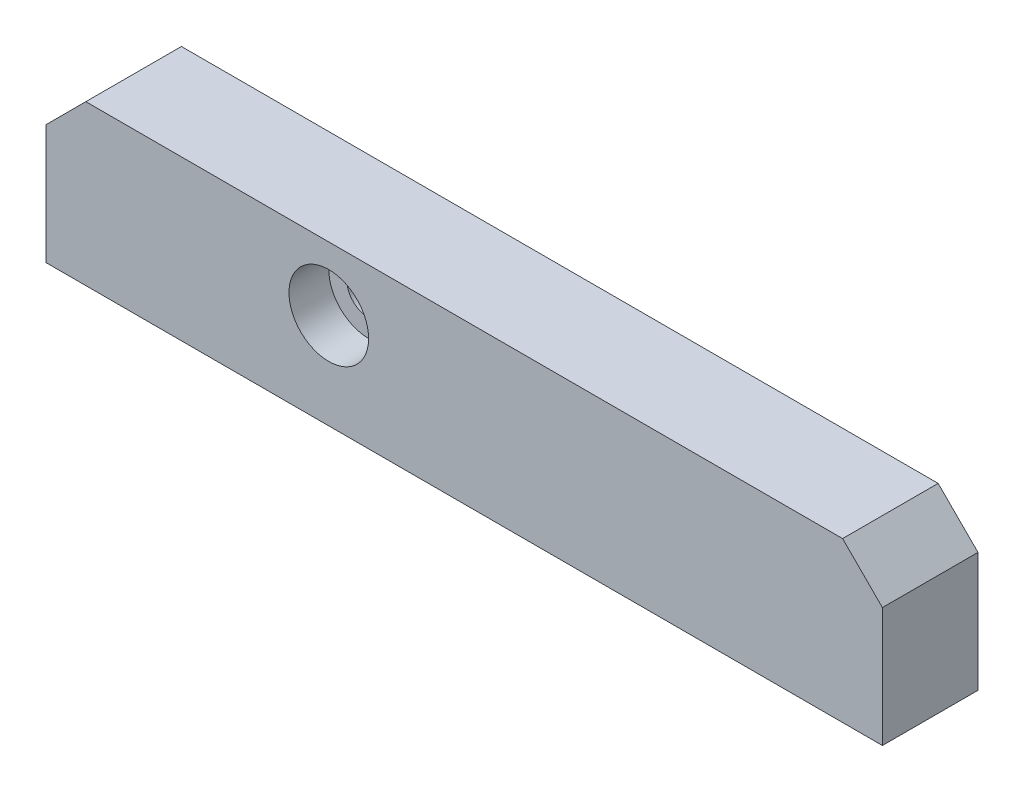
ISO-10303-21;
HEADER;
FILE_DESCRIPTION(('STEP AP214'),'2;1');
FILE_NAME('part.step','',(''),(''),'','','');
FILE_SCHEMA(('AUTOMOTIVE_DESIGN { 1 0 10303 214 1 1 1 1 }'));
ENDSEC;
DATA;
#1=APPLICATION_CONTEXT('core data for automotive mechanical design processes');
#2=APPLICATION_PROTOCOL_DEFINITION('international standard','automotive_design',2000,#1);
#3=PRODUCT_CONTEXT('',#1,'mechanical');
#4=PRODUCT('Part','Part','',(#3));
#5=PRODUCT_RELATED_PRODUCT_CATEGORY('part','',(#4));
#6=PRODUCT_DEFINITION_FORMATION('','',#4);
#7=PRODUCT_DEFINITION_CONTEXT('part definition',#1,'design');
#8=PRODUCT_DEFINITION('design','',#6,#7);
#9=PRODUCT_DEFINITION_SHAPE('','',#8);
#10=(LENGTH_UNIT() NAMED_UNIT(*) SI_UNIT(.MILLI.,.METRE.));
#11=(NAMED_UNIT(*) PLANE_ANGLE_UNIT() SI_UNIT($,.RADIAN.));
#12=(NAMED_UNIT(*) SI_UNIT($,.STERADIAN.) SOLID_ANGLE_UNIT());
#13=UNCERTAINTY_MEASURE_WITH_UNIT(LENGTH_MEASURE(1.E-05),#10,'distance_accuracy_value','');
#14=(GEOMETRIC_REPRESENTATION_CONTEXT(3) GLOBAL_UNCERTAINTY_ASSIGNED_CONTEXT((#13)) GLOBAL_UNIT_ASSIGNED_CONTEXT((#10,
#11,#12)) REPRESENTATION_CONTEXT('',''));
#15=CARTESIAN_POINT('',(0.,0.,0.));
#16=DIRECTION('',(0.,0.,1.));
#17=DIRECTION('',(1.,0.,0.));
#18=AXIS2_PLACEMENT_3D('',#15,#16,#17);
#19=CARTESIAN_POINT('',(-52.5,0.,12.));
#20=DIRECTION('',(1.,0.,0.));
#21=DIRECTION('',(0.,1.,0.));
#22=AXIS2_PLACEMENT_3D('',#19,#20,#21);
#23=PLANE('',#22);
#24=DIRECTION('',(0.,-1.,0.));
#25=VECTOR('',#24,1.);
#26=CARTESIAN_POINT('',(-52.5,0.,0.));
#27=LINE('',#26,#25);
#28=CARTESIAN_POINT('',(-52.5,15.,0.));
#29=VERTEX_POINT('',#28);
#30=CARTESIAN_POINT('',(-52.5,0.,0.));
#31=VERTEX_POINT('',#30);
#32=EDGE_CURVE('E132',#29,#31,#27,.T.);
#33=ORIENTED_EDGE('',*,*,#32,.T.);
#34=DIRECTION('',(0.,0.,-1.));
#35=VECTOR('',#34,1.);
#36=CARTESIAN_POINT('',(-52.5,0.,12.));
#37=LINE('',#36,#35);
#38=CARTESIAN_POINT('',(-52.5,0.,12.));
#39=VERTEX_POINT('',#38);
#40=EDGE_CURVE('E11',#39,#31,#37,.T.);
#41=ORIENTED_EDGE('',*,*,#40,.F.);
#42=DIRECTION('',(0.,-1.,0.));
#43=VECTOR('',#42,1.);
#44=CARTESIAN_POINT('',(-52.5,0.,12.));
#45=LINE('',#44,#43);
#46=CARTESIAN_POINT('',(-52.5,15.,12.));
#47=VERTEX_POINT('',#46);
#48=EDGE_CURVE('E143',#47,#39,#45,.T.);
#49=ORIENTED_EDGE('',*,*,#48,.F.);
#50=DIRECTION('',(0.,0.,-1.));
#51=VECTOR('',#50,1.);
#52=CARTESIAN_POINT('',(-52.5,15.,12.));
#53=LINE('',#52,#51);
#54=EDGE_CURVE('E128',#47,#29,#53,.T.);
#55=ORIENTED_EDGE('',*,*,#54,.T.);
#56=EDGE_LOOP('',(#33,#41,#49,#55));
#57=FACE_BOUND('',#56,.T.);
#58=ADVANCED_FACE('F45',(#57),#23,.F.);
#59=CARTESIAN_POINT('',(-52.5,0.,12.));
#60=DIRECTION('',(0.,1.,0.));
#61=DIRECTION('',(-1.,0.,0.));
#62=AXIS2_PLACEMENT_3D('',#59,#60,#61);
#63=PLANE('',#62);
#64=CARTESIAN_POINT('',(-37.5,0.,6.));
#65=DIRECTION('',(0.,-1.,0.));
#66=DIRECTION('',(0.,0.,-1.));
#67=AXIS2_PLACEMENT_3D('',#64,#65,#66);
#68=CIRCLE('',#67,2.09999999999999);
#69=CARTESIAN_POINT('',(-37.5,0.,3.90000000000001));
#70=VERTEX_POINT('',#69);
#71=EDGE_CURVE('E280',#70,#70,#68,.T.);
#72=ORIENTED_EDGE('',*,*,#71,.F.);
#73=EDGE_LOOP('',(#72));
#74=FACE_BOUND('',#73,.T.);
#75=CARTESIAN_POINT('',(37.5,0.,6.));
#76=DIRECTION('',(0.,-1.,0.));
#77=DIRECTION('',(0.,0.,-1.));
#78=AXIS2_PLACEMENT_3D('',#75,#76,#77);
#79=CIRCLE('',#78,2.09999999999999);
#80=CARTESIAN_POINT('',(37.5,0.,3.90000000000001));
#81=VERTEX_POINT('',#80);
#82=EDGE_CURVE('E282',#81,#81,#79,.T.);
#83=ORIENTED_EDGE('',*,*,#82,.F.);
#84=EDGE_LOOP('',(#83));
#85=FACE_BOUND('',#84,.T.);
#86=DIRECTION('',(1.,0.,0.));
#87=VECTOR('',#86,1.);
#88=CARTESIAN_POINT('',(-52.5,0.,0.));
#89=LINE('',#88,#87);
#90=CARTESIAN_POINT('',(52.5,0.,0.));
#91=VERTEX_POINT('',#90);
#92=EDGE_CURVE('E135',#31,#91,#89,.T.);
#93=ORIENTED_EDGE('',*,*,#92,.T.);
#94=DIRECTION('',(0.,0.,-1.));
#95=VECTOR('',#94,1.);
#96=CARTESIAN_POINT('',(52.5,0.,12.));
#97=LINE('',#96,#95);
#98=CARTESIAN_POINT('',(52.5,0.,12.));
#99=VERTEX_POINT('',#98);
#100=EDGE_CURVE('E53',#99,#91,#97,.T.);
#101=ORIENTED_EDGE('',*,*,#100,.F.);
#102=DIRECTION('',(1.,0.,0.));
#103=VECTOR('',#102,1.);
#104=CARTESIAN_POINT('',(-52.5,0.,12.));
#105=LINE('',#104,#103);
#106=EDGE_CURVE('E99',#39,#99,#105,.T.);
#107=ORIENTED_EDGE('',*,*,#106,.F.);
#108=ORIENTED_EDGE('',*,*,#40,.T.);
#109=EDGE_LOOP('',(#93,#101,#107,#108));
#110=FACE_BOUND('',#109,.T.);
#111=ADVANCED_FACE('F168',(#74,#85,#110),#63,.F.);
#112=CARTESIAN_POINT('',(52.5,0.,12.));
#113=DIRECTION('',(-1.,0.,0.));
#114=DIRECTION('',(0.,-1.,0.));
#115=AXIS2_PLACEMENT_3D('',#112,#113,#114);
#116=PLANE('',#115);
#117=DIRECTION('',(0.,1.,0.));
#118=VECTOR('',#117,1.);
#119=CARTESIAN_POINT('',(52.5,0.,0.));
#120=LINE('',#119,#118);
#121=CARTESIAN_POINT('',(52.5,15.,0.));
#122=VERTEX_POINT('',#121);
#123=EDGE_CURVE('E138',#91,#122,#120,.T.);
#124=ORIENTED_EDGE('',*,*,#123,.T.);
#125=DIRECTION('',(0.,0.,-1.));
#126=VECTOR('',#125,1.);
#127=CARTESIAN_POINT('',(52.5,15.,12.));
#128=LINE('',#127,#126);
#129=CARTESIAN_POINT('',(52.5,15.,12.));
#130=VERTEX_POINT('',#129);
#131=EDGE_CURVE('E123',#130,#122,#128,.T.);
#132=ORIENTED_EDGE('',*,*,#131,.F.);
#133=DIRECTION('',(0.,1.,0.));
#134=VECTOR('',#133,1.);
#135=CARTESIAN_POINT('',(52.5,0.,12.));
#136=LINE('',#135,#134);
#137=EDGE_CURVE('E114',#99,#130,#136,.T.);
#138=ORIENTED_EDGE('',*,*,#137,.F.);
#139=ORIENTED_EDGE('',*,*,#100,.T.);
#140=EDGE_LOOP('',(#124,#132,#138,#139));
#141=FACE_BOUND('',#140,.T.);
#142=ADVANCED_FACE('F149',(#141),#116,.F.);
#143=CARTESIAN_POINT('',(47.5,20.,12.));
#144=DIRECTION('',(-0.707106781186548,-0.707106781186547,0.));
#145=DIRECTION('',(0.707106781186547,-0.707106781186548,0.));
#146=AXIS2_PLACEMENT_3D('',#143,#144,#145);
#147=PLANE('',#146);
#148=DIRECTION('',(-0.707106781186547,0.707106781186548,0.));
#149=VECTOR('',#148,1.);
#150=CARTESIAN_POINT('',(47.5,20.,0.));
#151=LINE('',#150,#149);
#152=CARTESIAN_POINT('',(47.5,20.,0.));
#153=VERTEX_POINT('',#152);
#154=EDGE_CURVE('E122',#122,#153,#151,.T.);
#155=ORIENTED_EDGE('',*,*,#154,.T.);
#156=DIRECTION('',(0.,0.,-1.));
#157=VECTOR('',#156,1.);
#158=CARTESIAN_POINT('',(47.5,20.,12.));
#159=LINE('',#158,#157);
#160=CARTESIAN_POINT('',(47.5,20.,12.));
#161=VERTEX_POINT('',#160);
#162=EDGE_CURVE('E119',#161,#153,#159,.T.);
#163=ORIENTED_EDGE('',*,*,#162,.F.);
#164=DIRECTION('',(-0.707106781186547,0.707106781186548,0.));
#165=VECTOR('',#164,1.);
#166=CARTESIAN_POINT('',(47.5,20.,12.));
#167=LINE('',#166,#165);
#168=EDGE_CURVE('E108',#130,#161,#167,.T.);
#169=ORIENTED_EDGE('',*,*,#168,.F.);
#170=ORIENTED_EDGE('',*,*,#131,.T.);
#171=EDGE_LOOP('',(#155,#163,#169,#170));
#172=FACE_BOUND('',#171,.T.);
#173=ADVANCED_FACE('F120',(#172),#147,.F.);
#174=CARTESIAN_POINT('',(-47.5,20.,12.));
#175=DIRECTION('',(0.,-1.,0.));
#176=DIRECTION('',(1.,0.,0.));
#177=AXIS2_PLACEMENT_3D('',#174,#175,#176);
#178=PLANE('',#177);
#179=DIRECTION('',(-1.,0.,0.));
#180=VECTOR('',#179,1.);
#181=CARTESIAN_POINT('',(-47.5,20.,0.));
#182=LINE('',#181,#180);
#183=CARTESIAN_POINT('',(-47.5,20.,0.));
#184=VERTEX_POINT('',#183);
#185=EDGE_CURVE('E85',#153,#184,#182,.T.);
#186=ORIENTED_EDGE('',*,*,#185,.T.);
#187=DIRECTION('',(0.,0.,-1.));
#188=VECTOR('',#187,1.);
#189=CARTESIAN_POINT('',(-47.5,20.,12.));
#190=LINE('',#189,#188);
#191=CARTESIAN_POINT('',(-47.5,20.,12.));
#192=VERTEX_POINT('',#191);
#193=EDGE_CURVE('E124',#192,#184,#190,.T.);
#194=ORIENTED_EDGE('',*,*,#193,.F.);
#195=DIRECTION('',(-1.,0.,0.));
#196=VECTOR('',#195,1.);
#197=CARTESIAN_POINT('',(-47.5,20.,12.));
#198=LINE('',#197,#196);
#199=EDGE_CURVE('E112',#161,#192,#198,.T.);
#200=ORIENTED_EDGE('',*,*,#199,.F.);
#201=ORIENTED_EDGE('',*,*,#162,.T.);
#202=EDGE_LOOP('',(#186,#194,#200,#201));
#203=FACE_BOUND('',#202,.T.);
#204=ADVANCED_FACE('F126',(#203),#178,.F.);
#205=CARTESIAN_POINT('',(-47.5,20.,12.));
#206=DIRECTION('',(0.707106781186548,-0.707106781186547,0.));
#207=DIRECTION('',(0.707106781186547,0.707106781186548,0.));
#208=AXIS2_PLACEMENT_3D('',#205,#206,#207);
#209=PLANE('',#208);
#210=DIRECTION('',(-0.707106781186547,-0.707106781186548,0.));
#211=VECTOR('',#210,1.);
#212=CARTESIAN_POINT('',(-47.5,20.,0.));
#213=LINE('',#212,#211);
#214=EDGE_CURVE('E91',#184,#29,#213,.T.);
#215=ORIENTED_EDGE('',*,*,#214,.T.);
#216=ORIENTED_EDGE('',*,*,#54,.F.);
#217=DIRECTION('',(-0.707106781186547,-0.707106781186548,0.));
#218=VECTOR('',#217,1.);
#219=CARTESIAN_POINT('',(-47.5,20.,12.));
#220=LINE('',#219,#218);
#221=EDGE_CURVE('E61',#192,#47,#220,.T.);
#222=ORIENTED_EDGE('',*,*,#221,.F.);
#223=ORIENTED_EDGE('',*,*,#193,.T.);
#224=EDGE_LOOP('',(#215,#216,#222,#223));
#225=FACE_BOUND('',#224,.T.);
#226=ADVANCED_FACE('F156',(#225),#209,.F.);
#227=CARTESIAN_POINT('',(-52.5,20.,12.));
#228=DIRECTION('',(0.,0.,-1.));
#229=DIRECTION('',(-1.,0.,0.));
#230=AXIS2_PLACEMENT_3D('',#227,#228,#229);
#231=PLANE('',#230);
#232=CARTESIAN_POINT('',(-17.,12.,12.));
#233=DIRECTION('',(0.,0.,1.));
#234=DIRECTION('',(1.,0.,0.));
#235=AXIS2_PLACEMENT_3D('',#232,#233,#234);
#236=CIRCLE('',#235,4.99999999999999);
#237=CARTESIAN_POINT('',(-12.,12.,12.));
#238=VERTEX_POINT('',#237);
#239=EDGE_CURVE('E290',#238,#238,#236,.T.);
#240=ORIENTED_EDGE('',*,*,#239,.F.);
#241=EDGE_LOOP('',(#240));
#242=FACE_BOUND('',#241,.T.);
#243=ORIENTED_EDGE('',*,*,#48,.T.);
#244=ORIENTED_EDGE('',*,*,#106,.T.);
#245=ORIENTED_EDGE('',*,*,#137,.T.);
#246=ORIENTED_EDGE('',*,*,#168,.T.);
#247=ORIENTED_EDGE('',*,*,#199,.T.);
#248=ORIENTED_EDGE('',*,*,#221,.T.);
#249=EDGE_LOOP('',(#243,#244,#245,#246,#247,#248));
#250=FACE_BOUND('',#249,.T.);
#251=ADVANCED_FACE('F110',(#242,#250),#231,.F.);
#252=CARTESIAN_POINT('',(-52.5,20.,0.));
#253=DIRECTION('',(0.,0.,-1.));
#254=DIRECTION('',(-1.,0.,0.));
#255=AXIS2_PLACEMENT_3D('',#252,#253,#254);
#256=PLANE('',#255);
#257=CARTESIAN_POINT('',(-17.,12.,0.));
#258=DIRECTION('',(0.,0.,1.));
#259=DIRECTION('',(1.,0.,0.));
#260=AXIS2_PLACEMENT_3D('',#257,#258,#259);
#261=CIRCLE('',#260,2.75);
#262=CARTESIAN_POINT('',(-14.25,12.,0.));
#263=VERTEX_POINT('',#262);
#264=EDGE_CURVE('E136',#263,#263,#261,.T.);
#265=ORIENTED_EDGE('',*,*,#264,.T.);
#266=EDGE_LOOP('',(#265));
#267=FACE_BOUND('',#266,.T.);
#268=ORIENTED_EDGE('',*,*,#32,.F.);
#269=ORIENTED_EDGE('',*,*,#214,.F.);
#270=ORIENTED_EDGE('',*,*,#185,.F.);
#271=ORIENTED_EDGE('',*,*,#154,.F.);
#272=ORIENTED_EDGE('',*,*,#123,.F.);
#273=ORIENTED_EDGE('',*,*,#92,.F.);
#274=EDGE_LOOP('',(#268,#269,#270,#271,#272,#273));
#275=FACE_BOUND('',#274,.T.);
#276=ADVANCED_FACE('F152',(#267,#275),#256,.T.);
#277=CARTESIAN_POINT('',(-17.,12.,12.));
#278=DIRECTION('',(0.,0.,1.));
#279=DIRECTION('',(1.,0.,0.));
#280=AXIS2_PLACEMENT_3D('',#277,#278,#279);
#281=CYLINDRICAL_SURFACE('',#280,2.75);
#282=ORIENTED_EDGE('',*,*,#264,.F.);
#283=EDGE_LOOP('',(#282));
#284=FACE_BOUND('',#283,.T.);
#285=CARTESIAN_POINT('',(-17.,12.,7.));
#286=DIRECTION('',(0.,0.,1.));
#287=DIRECTION('',(1.,0.,0.));
#288=AXIS2_PLACEMENT_3D('',#285,#286,#287);
#289=CIRCLE('',#288,2.75000000000001);
#290=CARTESIAN_POINT('',(-14.25,12.,7.));
#291=VERTEX_POINT('',#290);
#292=EDGE_CURVE('E296',#291,#291,#289,.T.);
#293=ORIENTED_EDGE('',*,*,#292,.T.);
#294=EDGE_LOOP('',(#293));
#295=FACE_BOUND('',#294,.T.);
#296=ADVANCED_FACE('F204',(#284,#295),#281,.F.);
#297=CARTESIAN_POINT('',(-14.25,12.,7.));
#298=DIRECTION('',(0.,0.,-1.));
#299=DIRECTION('',(-1.,0.,0.));
#300=AXIS2_PLACEMENT_3D('',#297,#298,#299);
#301=PLANE('',#300);
#302=ORIENTED_EDGE('',*,*,#292,.F.);
#303=EDGE_LOOP('',(#302));
#304=FACE_BOUND('',#303,.T.);
#305=CARTESIAN_POINT('',(-17.,12.,7.));
#306=DIRECTION('',(0.,0.,1.));
#307=DIRECTION('',(1.,0.,0.));
#308=AXIS2_PLACEMENT_3D('',#305,#306,#307);
#309=CIRCLE('',#308,4.99999999999999);
#310=CARTESIAN_POINT('',(-12.,12.,7.));
#311=VERTEX_POINT('',#310);
#312=EDGE_CURVE('E293',#311,#311,#309,.T.);
#313=ORIENTED_EDGE('',*,*,#312,.T.);
#314=EDGE_LOOP('',(#313));
#315=FACE_BOUND('',#314,.T.);
#316=ADVANCED_FACE('F211',(#304,#315),#301,.F.);
#317=CARTESIAN_POINT('',(-17.,12.,12.));
#318=DIRECTION('',(0.,0.,1.));
#319=DIRECTION('',(1.,0.,0.));
#320=AXIS2_PLACEMENT_3D('',#317,#318,#319);
#321=CYLINDRICAL_SURFACE('',#320,4.99999999999999);
#322=ORIENTED_EDGE('',*,*,#312,.F.);
#323=EDGE_LOOP('',(#322));
#324=FACE_BOUND('',#323,.T.);
#325=ORIENTED_EDGE('',*,*,#239,.T.);
#326=EDGE_LOOP('',(#325));
#327=FACE_BOUND('',#326,.T.);
#328=ADVANCED_FACE('F219',(#324,#327),#321,.F.);
#329=CARTESIAN_POINT('',(37.5,14.,6.));
#330=DIRECTION('',(0.,-1.,0.));
#331=DIRECTION('',(0.,0.,-1.));
#332=AXIS2_PLACEMENT_3D('',#329,#330,#331);
#333=CONICAL_SURFACE('',#332,2.1,1.02974425867665);
#334=CARTESIAN_POINT('',(37.5,15.2618072999579,6.));
#335=VERTEX_POINT('',#334);
#336=VERTEX_LOOP('',#335);
#337=FACE_BOUND('',#336,.T.);
#338=CARTESIAN_POINT('',(37.5,14.,6.));
#339=DIRECTION('',(0.,-1.,0.));
#340=DIRECTION('',(0.,0.,-1.));
#341=AXIS2_PLACEMENT_3D('',#338,#339,#340);
#342=CIRCLE('',#341,2.1);
#343=CARTESIAN_POINT('',(37.5,14.,3.9));
#344=VERTEX_POINT('',#343);
#345=EDGE_CURVE('E287',#344,#344,#342,.T.);
#346=ORIENTED_EDGE('',*,*,#345,.T.);
#347=EDGE_LOOP('',(#346));
#348=FACE_BOUND('',#347,.T.);
#349=ADVANCED_FACE('F226',(#337,#348),#333,.F.);
#350=CARTESIAN_POINT('',(37.5,0.,6.));
#351=DIRECTION('',(0.,-1.,0.));
#352=DIRECTION('',(0.,0.,-1.));
#353=AXIS2_PLACEMENT_3D('',#350,#351,#352);
#354=CYLINDRICAL_SURFACE('',#353,2.09999999999999);
#355=ORIENTED_EDGE('',*,*,#345,.F.);
#356=EDGE_LOOP('',(#355));
#357=FACE_BOUND('',#356,.T.);
#358=ORIENTED_EDGE('',*,*,#82,.T.);
#359=EDGE_LOOP('',(#358));
#360=FACE_BOUND('',#359,.T.);
#361=ADVANCED_FACE('F233',(#357,#360),#354,.F.);
#362=CARTESIAN_POINT('',(-37.5,14.,6.));
#363=DIRECTION('',(0.,-1.,0.));
#364=DIRECTION('',(0.,0.,-1.));
#365=AXIS2_PLACEMENT_3D('',#362,#363,#364);
#366=CONICAL_SURFACE('',#365,2.1,1.02974425867665);
#367=CARTESIAN_POINT('',(-37.5,15.2618072999579,6.));
#368=VERTEX_POINT('',#367);
#369=VERTEX_LOOP('',#368);
#370=FACE_BOUND('',#369,.T.);
#371=CARTESIAN_POINT('',(-37.5,14.,6.));
#372=DIRECTION('',(0.,-1.,0.));
#373=DIRECTION('',(0.,0.,-1.));
#374=AXIS2_PLACEMENT_3D('',#371,#372,#373);
#375=CIRCLE('',#374,2.1);
#376=CARTESIAN_POINT('',(-37.5,14.,3.9));
#377=VERTEX_POINT('',#376);
#378=EDGE_CURVE('E278',#377,#377,#375,.T.);
#379=ORIENTED_EDGE('',*,*,#378,.T.);
#380=EDGE_LOOP('',(#379));
#381=FACE_BOUND('',#380,.T.);
#382=ADVANCED_FACE('F242',(#370,#381),#366,.F.);
#383=CARTESIAN_POINT('',(-37.5,0.,6.));
#384=DIRECTION('',(0.,-1.,0.));
#385=DIRECTION('',(0.,0.,-1.));
#386=AXIS2_PLACEMENT_3D('',#383,#384,#385);
#387=CYLINDRICAL_SURFACE('',#386,2.09999999999999);
#388=ORIENTED_EDGE('',*,*,#378,.F.);
#389=EDGE_LOOP('',(#388));
#390=FACE_BOUND('',#389,.T.);
#391=ORIENTED_EDGE('',*,*,#71,.T.);
#392=EDGE_LOOP('',(#391));
#393=FACE_BOUND('',#392,.T.);
#394=ADVANCED_FACE('F251',(#390,#393),#387,.F.);
#395=CLOSED_SHELL('',(#58,#111,#142,#173,#204,#226,#251,#276,#296,#316,#328,#349,#361,#382,#394));
#396=MANIFOLD_SOLID_BREP('B2',#395);
#397=ADVANCED_BREP_SHAPE_REPRESENTATION('',(#18,#396),#14);
#398=SHAPE_DEFINITION_REPRESENTATION(#9,#397);
ENDSEC;
END-ISO-10303-21;
